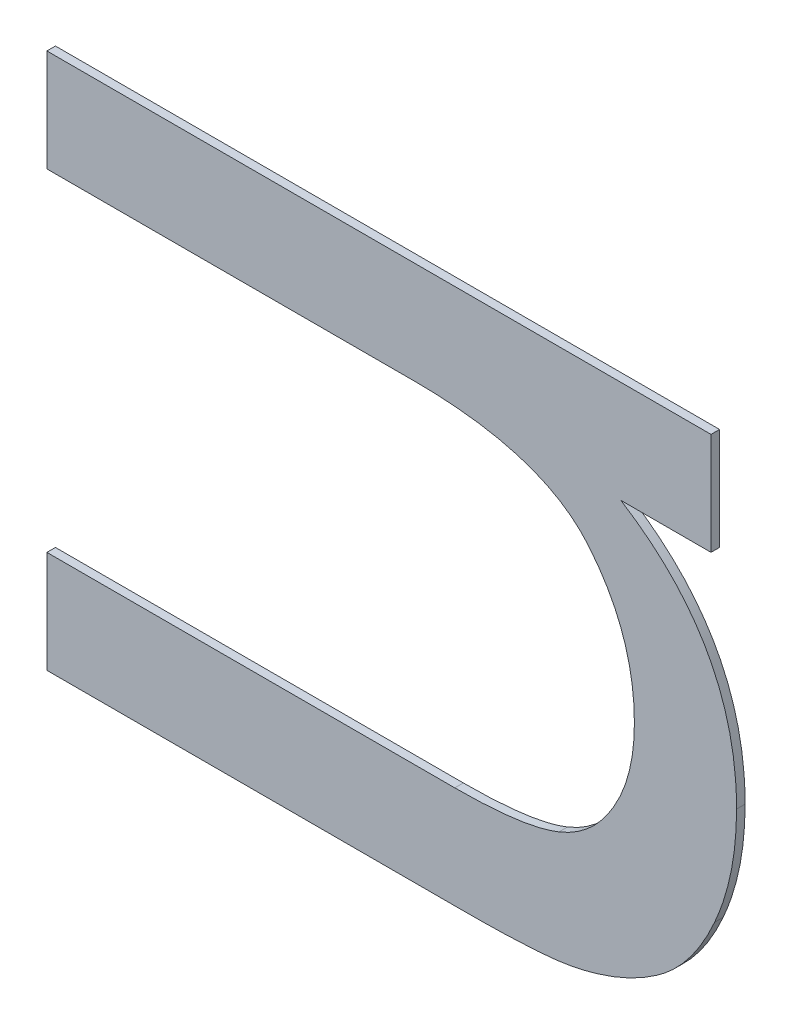
ISO-10303-21;
HEADER;
FILE_DESCRIPTION(('STEP AP214'),'2;1');
FILE_NAME('part.step','',(''),(''),'','','');
FILE_SCHEMA(('AUTOMOTIVE_DESIGN { 1 0 10303 214 1 1 1 1 }'));
ENDSEC;
DATA;
#1=APPLICATION_CONTEXT('core data for automotive mechanical design processes');
#2=APPLICATION_PROTOCOL_DEFINITION('international standard','automotive_design',2000,#1);
#3=PRODUCT_CONTEXT('',#1,'mechanical');
#4=PRODUCT('Part','Part','',(#3));
#5=PRODUCT_RELATED_PRODUCT_CATEGORY('part','',(#4));
#6=PRODUCT_DEFINITION_FORMATION('','',#4);
#7=PRODUCT_DEFINITION_CONTEXT('part definition',#1,'design');
#8=PRODUCT_DEFINITION('design','',#6,#7);
#9=PRODUCT_DEFINITION_SHAPE('','',#8);
#10=(LENGTH_UNIT() NAMED_UNIT(*) SI_UNIT(.MILLI.,.METRE.));
#11=(NAMED_UNIT(*) PLANE_ANGLE_UNIT() SI_UNIT($,.RADIAN.));
#12=(NAMED_UNIT(*) SI_UNIT($,.STERADIAN.) SOLID_ANGLE_UNIT());
#13=UNCERTAINTY_MEASURE_WITH_UNIT(LENGTH_MEASURE(1.E-05),#10,'distance_accuracy_value','');
#14=(GEOMETRIC_REPRESENTATION_CONTEXT(3) GLOBAL_UNCERTAINTY_ASSIGNED_CONTEXT((#13)) GLOBAL_UNIT_ASSIGNED_CONTEXT((#10,
#11,#12)) REPRESENTATION_CONTEXT('',''));
#15=CARTESIAN_POINT('',(0.,0.,0.));
#16=DIRECTION('',(0.,0.,1.));
#17=DIRECTION('',(1.,0.,0.));
#18=AXIS2_PLACEMENT_3D('',#15,#16,#17);
#19=CARTESIAN_POINT('',(1.1006089778178,1.5235473365811,1.7496000059366));
#20=DIRECTION('',(0.,1.,0.));
#21=DIRECTION('',(0.,0.,1.));
#22=AXIS2_PLACEMENT_3D('',#19,#20,#21);
#23=PLANE('',#22);
#24=DIRECTION('',(0.,0.,1.));
#25=VECTOR('',#24,1.);
#26=CARTESIAN_POINT('',(1.0850641795163,1.5235473365811,1.7492000059366));
#27=LINE('',#26,#25);
#28=CARTESIAN_POINT('',(1.0850641795163,1.5235473365811,1.7492000059366));
#29=VERTEX_POINT('',#28);
#30=CARTESIAN_POINT('',(1.0850641795163,1.5235473365811,1.7496000059366));
#31=VERTEX_POINT('',#30);
#32=EDGE_CURVE('E11',#29,#31,#27,.T.);
#33=ORIENTED_EDGE('',*,*,#32,.T.);
#34=DIRECTION('',(1.,0.,0.));
#35=VECTOR('',#34,1.);
#36=CARTESIAN_POINT('',(1.0850641795163,1.5235473365811,1.7496000059366));
#37=LINE('',#36,#35);
#38=CARTESIAN_POINT('',(1.1161537761193,1.5235473365811,1.7496000059366));
#39=VERTEX_POINT('',#38);
#40=EDGE_CURVE('E24',#31,#39,#37,.T.);
#41=ORIENTED_EDGE('',*,*,#40,.T.);
#42=DIRECTION('',(0.,0.,1.));
#43=VECTOR('',#42,1.);
#44=CARTESIAN_POINT('',(1.1161537761193,1.5235473365811,1.7492000059366));
#45=LINE('',#44,#43);
#46=CARTESIAN_POINT('',(1.1161537761193,1.5235473365811,1.7492000059366));
#47=VERTEX_POINT('',#46);
#48=EDGE_CURVE('E381',#47,#39,#45,.T.);
#49=ORIENTED_EDGE('',*,*,#48,.F.);
#50=DIRECTION('',(1.,0.,0.));
#51=VECTOR('',#50,1.);
#52=CARTESIAN_POINT('',(1.0850641795163,1.5235473365811,1.7492000059366));
#53=LINE('',#52,#51);
#54=EDGE_CURVE('E379',#29,#47,#53,.T.);
#55=ORIENTED_EDGE('',*,*,#54,.F.);
#56=EDGE_LOOP('',(#33,#41,#49,#55));
#57=FACE_BOUND('',#56,.T.);
#58=ADVANCED_FACE('F17',(#57),#23,.T.);
#59=CARTESIAN_POINT('',(1.1161537761193,1.5211558291501,1.7496000059366));
#60=DIRECTION('',(1.,0.,0.));
#61=DIRECTION('',(0.,0.,-1.));
#62=AXIS2_PLACEMENT_3D('',#59,#60,#61);
#63=PLANE('',#62);
#64=ORIENTED_EDGE('',*,*,#48,.T.);
#65=DIRECTION('',(0.,-1.,0.));
#66=VECTOR('',#65,1.);
#67=CARTESIAN_POINT('',(1.1161537761193,1.5235473365811,1.7496000059366));
#68=LINE('',#67,#66);
#69=CARTESIAN_POINT('',(1.1161537761193,1.5187643217191,1.7496000059366));
#70=VERTEX_POINT('',#69);
#71=EDGE_CURVE('E377',#39,#70,#68,.T.);
#72=ORIENTED_EDGE('',*,*,#71,.T.);
#73=DIRECTION('',(0.,0.,1.));
#74=VECTOR('',#73,1.);
#75=CARTESIAN_POINT('',(1.1161537761193,1.5187643217191,1.7492000059366));
#76=LINE('',#75,#74);
#77=CARTESIAN_POINT('',(1.1161537761193,1.5187643217191,1.7492000059366));
#78=VERTEX_POINT('',#77);
#79=EDGE_CURVE('E374',#78,#70,#76,.T.);
#80=ORIENTED_EDGE('',*,*,#79,.F.);
#81=DIRECTION('',(0.,-1.,0.));
#82=VECTOR('',#81,1.);
#83=CARTESIAN_POINT('',(1.1161537761193,1.5235473365811,1.7492000059366));
#84=LINE('',#83,#82);
#85=EDGE_CURVE('E371',#47,#78,#84,.T.);
#86=ORIENTED_EDGE('',*,*,#85,.F.);
#87=EDGE_LOOP('',(#64,#72,#80,#86));
#88=FACE_BOUND('',#87,.T.);
#89=ADVANCED_FACE('F387',(#88),#63,.T.);
#90=CARTESIAN_POINT('',(1.1140425234654,1.5187643217191,1.7496000059366));
#91=DIRECTION('',(0.,-1.,0.));
#92=DIRECTION('',(0.,0.,-1.));
#93=AXIS2_PLACEMENT_3D('',#90,#91,#92);
#94=PLANE('',#93);
#95=ORIENTED_EDGE('',*,*,#79,.T.);
#96=DIRECTION('',(-1.,0.,0.));
#97=VECTOR('',#96,1.);
#98=CARTESIAN_POINT('',(1.1161537761193,1.5187643217191,1.7496000059366));
#99=LINE('',#98,#97);
#100=CARTESIAN_POINT('',(1.1119312708115,1.5187643217191,1.7496000059366));
#101=VERTEX_POINT('',#100);
#102=EDGE_CURVE('E369',#70,#101,#99,.T.);
#103=ORIENTED_EDGE('',*,*,#102,.T.);
#104=DIRECTION('',(0.,0.,1.));
#105=VECTOR('',#104,1.);
#106=CARTESIAN_POINT('',(1.1119312708115,1.5187643217191,1.7492000059366));
#107=LINE('',#106,#105);
#108=CARTESIAN_POINT('',(1.1119312708115,1.5187643217191,1.7492000059366));
#109=VERTEX_POINT('',#108);
#110=EDGE_CURVE('E366',#109,#101,#107,.T.);
#111=ORIENTED_EDGE('',*,*,#110,.F.);
#112=DIRECTION('',(-1.,0.,0.));
#113=VECTOR('',#112,1.);
#114=CARTESIAN_POINT('',(1.1161537761193,1.5187643217191,1.7492000059366));
#115=LINE('',#114,#113);
#116=EDGE_CURVE('E360',#78,#109,#115,.T.);
#117=ORIENTED_EDGE('',*,*,#116,.F.);
#118=EDGE_LOOP('',(#95,#103,#111,#117));
#119=FACE_BOUND('',#118,.T.);
#120=ADVANCED_FACE('F393',(#119),#94,.T.);
#121=CARTESIAN_POINT('',(1.1119312708115,1.5187643217191,1.7496000059366));
#122=CARTESIAN_POINT('',(1.1119312708115,1.5187643217191,1.7491200059366));
#123=CARTESIAN_POINT('',(1.1173495298347,1.5153638970907,1.7496000059366));
#124=CARTESIAN_POINT('',(1.1173495298347,1.5153638970907,1.7491200059366));
#125=CARTESIAN_POINT('',(1.1173495298347,1.5089554045217,1.7496000059366));
#126=CARTESIAN_POINT('',(1.1173495298347,1.5089554045217,1.7491200059366));
#127=B_SPLINE_SURFACE_WITH_KNOTS('',2,1,((#121,#122),(#123,#124),(#125,#126)),.UNSPECIFIED.,.F.,
.F.,.F.,(3,3),(2,2),(0.,1.),(0.,0.000239999999999974),.UNSPECIFIED.);
#128=CARTESIAN_POINT('',(1.1119312708115,1.5187643217191,1.7496000059366));
#129=CARTESIAN_POINT('',(1.1173495298347,1.5153638970907,1.7496000059366));
#130=CARTESIAN_POINT('',(1.1173495298347,1.5089554045217,1.7496000059366));
#131=B_SPLINE_CURVE_WITH_KNOTS('',2,(#128,#129,#130),.UNSPECIFIED.,.F.,.F.,(3,3),(0.,1.),.UNSPECIFIED.);
#132=CARTESIAN_POINT('',(1.1173495298347,1.5089554045217,1.7496000059366));
#133=VERTEX_POINT('',#132);
#134=EDGE_CURVE('E356',#101,#133,#131,.T.);
#135=DIRECTION('',(0.,0.,1.));
#136=VECTOR('',#135,1.);
#137=CARTESIAN_POINT('',(1.1173495298347,1.5089554045217,1.7492000059366));
#138=LINE('',#137,#136);
#139=CARTESIAN_POINT('',(1.1173495298347,1.5089554045217,1.7492000059366));
#140=VERTEX_POINT('',#139);
#141=EDGE_CURVE('E350',#140,#133,#138,.T.);
#142=CARTESIAN_POINT('',(1.1119312708115,1.5187643217191,1.7492000059366));
#143=CARTESIAN_POINT('',(1.1173495298347,1.5153638970907,1.7492000059366));
#144=CARTESIAN_POINT('',(1.1173495298347,1.5089554045217,1.7492000059366));
#145=B_SPLINE_CURVE_WITH_KNOTS('',2,(#142,#143,#144),.UNSPECIFIED.,.F.,.F.,(3,3),(0.,1.),.UNSPECIFIED.);
#146=EDGE_CURVE('E342',#109,#140,#145,.T.);
#147=ORIENTED_EDGE('',*,*,#110,.T.);
#148=ORIENTED_EDGE('',*,*,#134,.T.);
#149=ORIENTED_EDGE('',*,*,#141,.F.);
#150=ORIENTED_EDGE('',*,*,#146,.F.);
#151=EDGE_LOOP('',(#147,#148,#149,#150));
#152=FACE_BOUND('',#151,.T.);
#153=ADVANCED_FACE('F397',(#152),#127,.T.);
#154=CARTESIAN_POINT('',(1.1173495298347,1.5089554045217,1.7496000059366));
#155=CARTESIAN_POINT('',(1.1173495298347,1.5089554045217,1.7491200059366));
#156=CARTESIAN_POINT('',(1.1173495298347,1.5061715404029,1.7496000059366));
#157=CARTESIAN_POINT('',(1.1173495298347,1.5061715404029,1.7491200059366));
#158=CARTESIAN_POINT('',(1.1163219289855,1.5038547675791,1.7496000059366));
#159=CARTESIAN_POINT('',(1.1163219289855,1.5038547675791,1.7491200059366));
#160=B_SPLINE_SURFACE_WITH_KNOTS('',2,1,((#154,#155),(#156,#157),(#158,#159)),.UNSPECIFIED.,.F.,
.F.,.F.,(3,3),(2,2),(0.,1.),(0.,0.000239999999999974),.UNSPECIFIED.);
#161=CARTESIAN_POINT('',(1.1173495298347,1.5089554045217,1.7496000059366));
#162=CARTESIAN_POINT('',(1.1173495298347,1.5061715404029,1.7496000059366));
#163=CARTESIAN_POINT('',(1.1163219289855,1.5038547675791,1.7496000059366));
#164=B_SPLINE_CURVE_WITH_KNOTS('',2,(#161,#162,#163),.UNSPECIFIED.,.F.,.F.,(3,3),(0.,1.),.UNSPECIFIED.);
#165=CARTESIAN_POINT('',(1.1163219289855,1.5038547675791,1.7496000059366));
#166=VERTEX_POINT('',#165);
#167=EDGE_CURVE('E338',#133,#166,#164,.T.);
#168=DIRECTION('',(0.,0.,1.));
#169=VECTOR('',#168,1.);
#170=CARTESIAN_POINT('',(1.1163219289855,1.5038547675791,1.7492000059366));
#171=LINE('',#170,#169);
#172=CARTESIAN_POINT('',(1.1163219289855,1.5038547675791,1.7492000059366));
#173=VERTEX_POINT('',#172);
#174=EDGE_CURVE('E332',#173,#166,#171,.T.);
#175=CARTESIAN_POINT('',(1.1173495298347,1.5089554045217,1.7492000059366));
#176=CARTESIAN_POINT('',(1.1173495298347,1.5061715404029,1.7492000059366));
#177=CARTESIAN_POINT('',(1.1163219289855,1.5038547675791,1.7492000059366));
#178=B_SPLINE_CURVE_WITH_KNOTS('',2,(#175,#176,#177),.UNSPECIFIED.,.F.,.F.,(3,3),(0.,1.),.UNSPECIFIED.);
#179=EDGE_CURVE('E324',#140,#173,#178,.T.);
#180=ORIENTED_EDGE('',*,*,#141,.T.);
#181=ORIENTED_EDGE('',*,*,#167,.T.);
#182=ORIENTED_EDGE('',*,*,#174,.F.);
#183=ORIENTED_EDGE('',*,*,#179,.F.);
#184=EDGE_LOOP('',(#180,#181,#182,#183));
#185=FACE_BOUND('',#184,.T.);
#186=ADVANCED_FACE('F401',(#185),#160,.T.);
#187=CARTESIAN_POINT('',(1.1163219289855,1.5038547675791,1.7496000059366));
#188=CARTESIAN_POINT('',(1.1163219289855,1.5038547675791,1.7491200059366));
#189=CARTESIAN_POINT('',(1.1152943281363,1.5015193111035,1.7496000059366));
#190=CARTESIAN_POINT('',(1.1152943281363,1.5015193111035,1.7491200059366));
#191=CARTESIAN_POINT('',(1.1136314831257,1.5003609246915,1.7496000059366));
#192=CARTESIAN_POINT('',(1.1136314831257,1.5003609246915,1.7491200059366));
#193=B_SPLINE_SURFACE_WITH_KNOTS('',2,1,((#187,#188),(#189,#190),(#191,#192)),.UNSPECIFIED.,.F.,
.F.,.F.,(3,3),(2,2),(0.,1.),(0.,0.000239999999999974),.UNSPECIFIED.);
#194=CARTESIAN_POINT('',(1.1163219289855,1.5038547675791,1.7496000059366));
#195=CARTESIAN_POINT('',(1.1152943281363,1.5015193111035,1.7496000059366));
#196=CARTESIAN_POINT('',(1.1136314831257,1.5003609246915,1.7496000059366));
#197=B_SPLINE_CURVE_WITH_KNOTS('',2,(#194,#195,#196),.UNSPECIFIED.,.F.,.F.,(3,3),(0.,1.),.UNSPECIFIED.);
#198=CARTESIAN_POINT('',(1.1136314831257,1.5003609246915,1.7496000059366));
#199=VERTEX_POINT('',#198);
#200=EDGE_CURVE('E320',#166,#199,#197,.T.);
#201=DIRECTION('',(0.,0.,1.));
#202=VECTOR('',#201,1.);
#203=CARTESIAN_POINT('',(1.1136314831257,1.5003609246915,1.7492000059366));
#204=LINE('',#203,#202);
#205=CARTESIAN_POINT('',(1.1136314831257,1.5003609246915,1.7492000059366));
#206=VERTEX_POINT('',#205);
#207=EDGE_CURVE('E314',#206,#199,#204,.T.);
#208=CARTESIAN_POINT('',(1.1163219289855,1.5038547675791,1.7492000059366));
#209=CARTESIAN_POINT('',(1.1152943281363,1.5015193111035,1.7492000059366));
#210=CARTESIAN_POINT('',(1.1136314831257,1.5003609246915,1.7492000059366));
#211=B_SPLINE_CURVE_WITH_KNOTS('',2,(#208,#209,#210),.UNSPECIFIED.,.F.,.F.,(3,3),(0.,1.),.UNSPECIFIED.);
#212=EDGE_CURVE('E306',#173,#206,#211,.T.);
#213=ORIENTED_EDGE('',*,*,#174,.T.);
#214=ORIENTED_EDGE('',*,*,#200,.T.);
#215=ORIENTED_EDGE('',*,*,#207,.F.);
#216=ORIENTED_EDGE('',*,*,#212,.F.);
#217=EDGE_LOOP('',(#213,#214,#215,#216));
#218=FACE_BOUND('',#217,.T.);
#219=ADVANCED_FACE('F404',(#218),#193,.T.);
#220=CARTESIAN_POINT('',(1.1136314831257,1.5003609246915,1.7496000059366));
#221=CARTESIAN_POINT('',(1.1136314831257,1.5003609246915,1.7491200059366));
#222=CARTESIAN_POINT('',(1.1119686381151,1.4991838546279,1.7496000059366));
#223=CARTESIAN_POINT('',(1.1119686381151,1.4991838546279,1.7491200059366));
#224=CARTESIAN_POINT('',(1.1096705489431,1.4987354469845,1.7496000059366));
#225=CARTESIAN_POINT('',(1.1096705489431,1.4987354469845,1.7491200059366));
#226=B_SPLINE_SURFACE_WITH_KNOTS('',2,1,((#220,#221),(#222,#223),(#224,#225)),.UNSPECIFIED.,.F.,
.F.,.F.,(3,3),(2,2),(0.,1.),(0.,0.000239999999999974),.UNSPECIFIED.);
#227=CARTESIAN_POINT('',(1.1136314831257,1.5003609246915,1.7496000059366));
#228=CARTESIAN_POINT('',(1.1119686381151,1.4991838546279,1.7496000059366));
#229=CARTESIAN_POINT('',(1.1096705489431,1.4987354469845,1.7496000059366));
#230=B_SPLINE_CURVE_WITH_KNOTS('',2,(#227,#228,#229),.UNSPECIFIED.,.F.,.F.,(3,3),(0.,1.),.UNSPECIFIED.);
#231=CARTESIAN_POINT('',(1.1096705489431,1.4987354469845,1.7496000059366));
#232=VERTEX_POINT('',#231);
#233=EDGE_CURVE('E302',#199,#232,#230,.T.);
#234=DIRECTION('',(0.,0.,1.));
#235=VECTOR('',#234,1.);
#236=CARTESIAN_POINT('',(1.1096705489431,1.4987354469845,1.7492000059366));
#237=LINE('',#236,#235);
#238=CARTESIAN_POINT('',(1.1096705489431,1.4987354469845,1.7492000059366));
#239=VERTEX_POINT('',#238);
#240=EDGE_CURVE('E296',#239,#232,#237,.T.);
#241=CARTESIAN_POINT('',(1.1136314831257,1.5003609246915,1.7492000059366));
#242=CARTESIAN_POINT('',(1.1119686381151,1.4991838546279,1.7492000059366));
#243=CARTESIAN_POINT('',(1.1096705489431,1.4987354469845,1.7492000059366));
#244=B_SPLINE_CURVE_WITH_KNOTS('',2,(#241,#242,#243),.UNSPECIFIED.,.F.,.F.,(3,3),(0.,1.),.UNSPECIFIED.);
#245=EDGE_CURVE('E288',#206,#239,#244,.T.);
#246=ORIENTED_EDGE('',*,*,#207,.T.);
#247=ORIENTED_EDGE('',*,*,#233,.T.);
#248=ORIENTED_EDGE('',*,*,#240,.F.);
#249=ORIENTED_EDGE('',*,*,#245,.F.);
#250=EDGE_LOOP('',(#246,#247,#248,#249));
#251=FACE_BOUND('',#250,.T.);
#252=ADVANCED_FACE('F409',(#251),#226,.T.);
#253=CARTESIAN_POINT('',(1.1096705489431,1.4987354469845,1.7496000059366));
#254=CARTESIAN_POINT('',(1.1096705489431,1.4987354469845,1.7491200059366));
#255=CARTESIAN_POINT('',(1.1081945404505,1.4984365085557,1.7496000059366));
#256=CARTESIAN_POINT('',(1.1081945404505,1.4984365085557,1.7491200059366));
#257=CARTESIAN_POINT('',(1.1044764937413,1.4984365085557,1.7496000059366));
#258=CARTESIAN_POINT('',(1.1044764937413,1.4984365085557,1.7491200059366));
#259=B_SPLINE_SURFACE_WITH_KNOTS('',2,1,((#253,#254),(#255,#256),(#257,#258)),.UNSPECIFIED.,.F.,
.F.,.F.,(3,3),(2,2),(0.,1.),(0.,0.000239999999999974),.UNSPECIFIED.);
#260=CARTESIAN_POINT('',(1.1096705489431,1.4987354469845,1.7496000059366));
#261=CARTESIAN_POINT('',(1.1081945404505,1.4984365085557,1.7496000059366));
#262=CARTESIAN_POINT('',(1.1044764937413,1.4984365085557,1.7496000059366));
#263=B_SPLINE_CURVE_WITH_KNOTS('',2,(#260,#261,#262),.UNSPECIFIED.,.F.,.F.,(3,3),(0.,1.),.UNSPECIFIED.);
#264=CARTESIAN_POINT('',(1.1044764937413,1.4984365085557,1.7496000059366));
#265=VERTEX_POINT('',#264);
#266=EDGE_CURVE('E284',#232,#265,#263,.T.);
#267=DIRECTION('',(0.,0.,1.));
#268=VECTOR('',#267,1.);
#269=CARTESIAN_POINT('',(1.1044764937413,1.4984365085557,1.7492000059366));
#270=LINE('',#269,#268);
#271=CARTESIAN_POINT('',(1.1044764937413,1.4984365085557,1.7492000059366));
#272=VERTEX_POINT('',#271);
#273=EDGE_CURVE('E278',#272,#265,#270,.T.);
#274=CARTESIAN_POINT('',(1.1096705489431,1.4987354469845,1.7492000059366));
#275=CARTESIAN_POINT('',(1.1081945404505,1.4984365085557,1.7492000059366));
#276=CARTESIAN_POINT('',(1.1044764937413,1.4984365085557,1.7492000059366));
#277=B_SPLINE_CURVE_WITH_KNOTS('',2,(#274,#275,#276),.UNSPECIFIED.,.F.,.F.,(3,3),(0.,1.),.UNSPECIFIED.);
#278=EDGE_CURVE('E273',#239,#272,#277,.T.);
#279=ORIENTED_EDGE('',*,*,#240,.T.);
#280=ORIENTED_EDGE('',*,*,#266,.T.);
#281=ORIENTED_EDGE('',*,*,#273,.F.);
#282=ORIENTED_EDGE('',*,*,#278,.F.);
#283=EDGE_LOOP('',(#279,#280,#281,#282));
#284=FACE_BOUND('',#283,.T.);
#285=ADVANCED_FACE('F413',(#284),#259,.T.);
#286=CARTESIAN_POINT('',(1.0947703366288,1.4984365085557,1.7496000059366));
#287=DIRECTION('',(0.,-1.,0.));
#288=DIRECTION('',(0.,0.,-1.));
#289=AXIS2_PLACEMENT_3D('',#286,#287,#288);
#290=PLANE('',#289);
#291=ORIENTED_EDGE('',*,*,#273,.T.);
#292=DIRECTION('',(-1.,0.,0.));
#293=VECTOR('',#292,1.);
#294=CARTESIAN_POINT('',(1.1044764937413,1.4984365085557,1.7496000059366));
#295=LINE('',#294,#293);
#296=CARTESIAN_POINT('',(1.0850641795163,1.4984365085557,1.7496000059366));
#297=VERTEX_POINT('',#296);
#298=EDGE_CURVE('E271',#265,#297,#295,.T.);
#299=ORIENTED_EDGE('',*,*,#298,.T.);
#300=DIRECTION('',(0.,0.,1.));
#301=VECTOR('',#300,1.);
#302=CARTESIAN_POINT('',(1.0850641795163,1.4984365085557,1.7492000059366));
#303=LINE('',#302,#301);
#304=CARTESIAN_POINT('',(1.0850641795163,1.4984365085557,1.7492000059366));
#305=VERTEX_POINT('',#304);
#306=EDGE_CURVE('E268',#305,#297,#303,.T.);
#307=ORIENTED_EDGE('',*,*,#306,.F.);
#308=DIRECTION('',(-1.,0.,0.));
#309=VECTOR('',#308,1.);
#310=CARTESIAN_POINT('',(1.1044764937413,1.4984365085557,1.7492000059366));
#311=LINE('',#310,#309);
#312=EDGE_CURVE('E265',#272,#305,#311,.T.);
#313=ORIENTED_EDGE('',*,*,#312,.F.);
#314=EDGE_LOOP('',(#291,#299,#307,#313));
#315=FACE_BOUND('',#314,.T.);
#316=ADVANCED_FACE('F417',(#315),#290,.T.);
#317=CARTESIAN_POINT('',(1.0850641795163,1.5008280159867,1.7496000059366));
#318=DIRECTION('',(-1.,0.,0.));
#319=DIRECTION('',(0.,0.,1.));
#320=AXIS2_PLACEMENT_3D('',#317,#318,#319);
#321=PLANE('',#320);
#322=ORIENTED_EDGE('',*,*,#306,.T.);
#323=DIRECTION('',(0.,1.,0.));
#324=VECTOR('',#323,1.);
#325=CARTESIAN_POINT('',(1.0850641795163,1.4984365085557,1.7496000059366));
#326=LINE('',#325,#324);
#327=CARTESIAN_POINT('',(1.0850641795163,1.5032195234177,1.7496000059366));
#328=VERTEX_POINT('',#327);
#329=EDGE_CURVE('E263',#297,#328,#326,.T.);
#330=ORIENTED_EDGE('',*,*,#329,.T.);
#331=DIRECTION('',(0.,0.,1.));
#332=VECTOR('',#331,1.);
#333=CARTESIAN_POINT('',(1.0850641795163,1.5032195234177,1.7492000059366));
#334=LINE('',#333,#332);
#335=CARTESIAN_POINT('',(1.0850641795163,1.5032195234177,1.7492000059366));
#336=VERTEX_POINT('',#335);
#337=EDGE_CURVE('E260',#336,#328,#334,.T.);
#338=ORIENTED_EDGE('',*,*,#337,.F.);
#339=DIRECTION('',(0.,1.,0.));
#340=VECTOR('',#339,1.);
#341=CARTESIAN_POINT('',(1.0850641795163,1.4984365085557,1.7492000059366));
#342=LINE('',#341,#340);
#343=EDGE_CURVE('E257',#305,#336,#342,.T.);
#344=ORIENTED_EDGE('',*,*,#343,.F.);
#345=EDGE_LOOP('',(#322,#330,#338,#344));
#346=FACE_BOUND('',#345,.T.);
#347=ADVANCED_FACE('F420',(#346),#321,.T.);
#348=CARTESIAN_POINT('',(1.0946115255885,1.5032195234177,1.7496000059366));
#349=DIRECTION('',(0.,1.,0.));
#350=DIRECTION('',(0.,0.,1.));
#351=AXIS2_PLACEMENT_3D('',#348,#349,#350);
#352=PLANE('',#351);
#353=ORIENTED_EDGE('',*,*,#337,.T.);
#354=DIRECTION('',(1.,0.,0.));
#355=VECTOR('',#354,1.);
#356=CARTESIAN_POINT('',(1.0850641795163,1.5032195234177,1.7496000059366));
#357=LINE('',#356,#355);
#358=CARTESIAN_POINT('',(1.1041588716607,1.5032195234177,1.7496000059366));
#359=VERTEX_POINT('',#358);
#360=EDGE_CURVE('E255',#328,#359,#357,.T.);
#361=ORIENTED_EDGE('',*,*,#360,.T.);
#362=DIRECTION('',(0.,0.,1.));
#363=VECTOR('',#362,1.);
#364=CARTESIAN_POINT('',(1.1041588716607,1.5032195234177,1.7492000059366));
#365=LINE('',#364,#363);
#366=CARTESIAN_POINT('',(1.1041588716607,1.5032195234177,1.7492000059366));
#367=VERTEX_POINT('',#366);
#368=EDGE_CURVE('E252',#367,#359,#365,.T.);
#369=ORIENTED_EDGE('',*,*,#368,.F.);
#370=DIRECTION('',(1.,0.,0.));
#371=VECTOR('',#370,1.);
#372=CARTESIAN_POINT('',(1.0850641795163,1.5032195234177,1.7492000059366));
#373=LINE('',#372,#371);
#374=EDGE_CURVE('E246',#336,#367,#373,.T.);
#375=ORIENTED_EDGE('',*,*,#374,.F.);
#376=EDGE_LOOP('',(#353,#361,#369,#375));
#377=FACE_BOUND('',#376,.T.);
#378=ADVANCED_FACE('F425',(#377),#352,.T.);
#379=CARTESIAN_POINT('',(1.1041588716607,1.5032195234177,1.7496000059366));
#380=CARTESIAN_POINT('',(1.1041588716607,1.5032195234177,1.7491200059366));
#381=CARTESIAN_POINT('',(1.1074285107265,1.5032195234177,1.7496000059366));
#382=CARTESIAN_POINT('',(1.1074285107265,1.5032195234177,1.7491200059366));
#383=CARTESIAN_POINT('',(1.1090353047817,1.5038734512309,1.7496000059366));
#384=CARTESIAN_POINT('',(1.1090353047817,1.5038734512309,1.7491200059366));
#385=B_SPLINE_SURFACE_WITH_KNOTS('',2,1,((#379,#380),(#381,#382),(#383,#384)),.UNSPECIFIED.,.F.,
.F.,.F.,(3,3),(2,2),(0.,1.),(0.,0.000239999999999974),.UNSPECIFIED.);
#386=CARTESIAN_POINT('',(1.1041588716607,1.5032195234177,1.7496000059366));
#387=CARTESIAN_POINT('',(1.1074285107265,1.5032195234177,1.7496000059366));
#388=CARTESIAN_POINT('',(1.1090353047817,1.5038734512309,1.7496000059366));
#389=B_SPLINE_CURVE_WITH_KNOTS('',2,(#386,#387,#388),.UNSPECIFIED.,.F.,.F.,(3,3),(0.,1.),.UNSPECIFIED.);
#390=CARTESIAN_POINT('',(1.1090353047817,1.5038734512309,1.7496000059366));
#391=VERTEX_POINT('',#390);
#392=EDGE_CURVE('E242',#359,#391,#389,.T.);
#393=DIRECTION('',(0.,0.,1.));
#394=VECTOR('',#393,1.);
#395=CARTESIAN_POINT('',(1.1090353047817,1.5038734512309,1.7492000059366));
#396=LINE('',#395,#394);
#397=CARTESIAN_POINT('',(1.1090353047817,1.5038734512309,1.7492000059366));
#398=VERTEX_POINT('',#397);
#399=EDGE_CURVE('E236',#398,#391,#396,.T.);
#400=CARTESIAN_POINT('',(1.1041588716607,1.5032195234177,1.7492000059366));
#401=CARTESIAN_POINT('',(1.1074285107265,1.5032195234177,1.7492000059366));
#402=CARTESIAN_POINT('',(1.1090353047817,1.5038734512309,1.7492000059366));
#403=B_SPLINE_CURVE_WITH_KNOTS('',2,(#400,#401,#402),.UNSPECIFIED.,.F.,.F.,(3,3),(0.,1.),.UNSPECIFIED.);
#404=EDGE_CURVE('E228',#367,#398,#403,.T.);
#405=ORIENTED_EDGE('',*,*,#368,.T.);
#406=ORIENTED_EDGE('',*,*,#392,.T.);
#407=ORIENTED_EDGE('',*,*,#399,.F.);
#408=ORIENTED_EDGE('',*,*,#404,.F.);
#409=EDGE_LOOP('',(#405,#406,#407,#408));
#410=FACE_BOUND('',#409,.T.);
#411=ADVANCED_FACE('F429',(#410),#385,.T.);
#412=CARTESIAN_POINT('',(1.1090353047817,1.5038734512309,1.7496000059366));
#413=CARTESIAN_POINT('',(1.1090353047817,1.5038734512309,1.7491200059366));
#414=CARTESIAN_POINT('',(1.1106420988369,1.5045086953923,1.7496000059366));
#415=CARTESIAN_POINT('',(1.1106420988369,1.5045086953923,1.7491200059366));
#416=CARTESIAN_POINT('',(1.1115949650789,1.5061715404029,1.7496000059366));
#417=CARTESIAN_POINT('',(1.1115949650789,1.5061715404029,1.7491200059366));
#418=B_SPLINE_SURFACE_WITH_KNOTS('',2,1,((#412,#413),(#414,#415),(#416,#417)),.UNSPECIFIED.,.F.,
.F.,.F.,(3,3),(2,2),(0.,1.),(0.,0.000239999999999974),.UNSPECIFIED.);
#419=CARTESIAN_POINT('',(1.1090353047817,1.5038734512309,1.7496000059366));
#420=CARTESIAN_POINT('',(1.1106420988369,1.5045086953923,1.7496000059366));
#421=CARTESIAN_POINT('',(1.1115949650789,1.5061715404029,1.7496000059366));
#422=B_SPLINE_CURVE_WITH_KNOTS('',2,(#419,#420,#421),.UNSPECIFIED.,.F.,.F.,(3,3),(0.,1.),.UNSPECIFIED.);
#423=CARTESIAN_POINT('',(1.1115949650789,1.5061715404029,1.7496000059366));
#424=VERTEX_POINT('',#423);
#425=EDGE_CURVE('E224',#391,#424,#422,.T.);
#426=DIRECTION('',(0.,0.,1.));
#427=VECTOR('',#426,1.);
#428=CARTESIAN_POINT('',(1.1115949650789,1.5061715404029,1.7492000059366));
#429=LINE('',#428,#427);
#430=CARTESIAN_POINT('',(1.1115949650789,1.5061715404029,1.7492000059366));
#431=VERTEX_POINT('',#430);
#432=EDGE_CURVE('E218',#431,#424,#429,.T.);
#433=CARTESIAN_POINT('',(1.1090353047817,1.5038734512309,1.7492000059366));
#434=CARTESIAN_POINT('',(1.1106420988369,1.5045086953923,1.7492000059366));
#435=CARTESIAN_POINT('',(1.1115949650789,1.5061715404029,1.7492000059366));
#436=B_SPLINE_CURVE_WITH_KNOTS('',2,(#433,#434,#435),.UNSPECIFIED.,.F.,.F.,(3,3),(0.,1.),.UNSPECIFIED.);
#437=EDGE_CURVE('E210',#398,#431,#436,.T.);
#438=ORIENTED_EDGE('',*,*,#399,.T.);
#439=ORIENTED_EDGE('',*,*,#425,.T.);
#440=ORIENTED_EDGE('',*,*,#432,.F.);
#441=ORIENTED_EDGE('',*,*,#437,.F.);
#442=EDGE_LOOP('',(#438,#439,#440,#441));
#443=FACE_BOUND('',#442,.T.);
#444=ADVANCED_FACE('F433',(#443),#418,.T.);
#445=CARTESIAN_POINT('',(1.1115949650789,1.5061715404029,1.7496000059366));
#446=CARTESIAN_POINT('',(1.1115949650789,1.5061715404029,1.7491200059366));
#447=CARTESIAN_POINT('',(1.1125665149727,1.5078157017617,1.7496000059366));
#448=CARTESIAN_POINT('',(1.1125665149727,1.5078157017617,1.7491200059366));
#449=CARTESIAN_POINT('',(1.1125665149727,1.5100577399781,1.7496000059366));
#450=CARTESIAN_POINT('',(1.1125665149727,1.5100577399781,1.7491200059366));
#451=B_SPLINE_SURFACE_WITH_KNOTS('',2,1,((#445,#446),(#447,#448),(#449,#450)),.UNSPECIFIED.,.F.,
.F.,.F.,(3,3),(2,2),(0.,1.),(0.,0.000239999999999974),.UNSPECIFIED.);
#452=CARTESIAN_POINT('',(1.1115949650789,1.5061715404029,1.7496000059366));
#453=CARTESIAN_POINT('',(1.1125665149727,1.5078157017617,1.7496000059366));
#454=CARTESIAN_POINT('',(1.1125665149727,1.5100577399781,1.7496000059366));
#455=B_SPLINE_CURVE_WITH_KNOTS('',2,(#452,#453,#454),.UNSPECIFIED.,.F.,.F.,(3,3),(0.,1.),.UNSPECIFIED.);
#456=CARTESIAN_POINT('',(1.1125665149727,1.5100577399781,1.7496000059366));
#457=VERTEX_POINT('',#456);
#458=EDGE_CURVE('E206',#424,#457,#455,.T.);
#459=DIRECTION('',(0.,0.,1.));
#460=VECTOR('',#459,1.);
#461=CARTESIAN_POINT('',(1.1125665149727,1.5100577399781,1.7492000059366));
#462=LINE('',#461,#460);
#463=CARTESIAN_POINT('',(1.1125665149727,1.5100577399781,1.7492000059366));
#464=VERTEX_POINT('',#463);
#465=EDGE_CURVE('E200',#464,#457,#462,.T.);
#466=CARTESIAN_POINT('',(1.1115949650789,1.5061715404029,1.7492000059366));
#467=CARTESIAN_POINT('',(1.1125665149727,1.5078157017617,1.7492000059366));
#468=CARTESIAN_POINT('',(1.1125665149727,1.5100577399781,1.7492000059366));
#469=B_SPLINE_CURVE_WITH_KNOTS('',2,(#466,#467,#468),.UNSPECIFIED.,.F.,.F.,(3,3),(0.,1.),.UNSPECIFIED.);
#470=EDGE_CURVE('E192',#431,#464,#469,.T.);
#471=ORIENTED_EDGE('',*,*,#432,.T.);
#472=ORIENTED_EDGE('',*,*,#458,.T.);
#473=ORIENTED_EDGE('',*,*,#465,.F.);
#474=ORIENTED_EDGE('',*,*,#470,.F.);
#475=EDGE_LOOP('',(#471,#472,#473,#474));
#476=FACE_BOUND('',#475,.T.);
#477=ADVANCED_FACE('F436',(#476),#451,.T.);
#478=CARTESIAN_POINT('',(1.1125665149727,1.5100577399781,1.7496000059366));
#479=CARTESIAN_POINT('',(1.1125665149727,1.5100577399781,1.7491200059366));
#480=CARTESIAN_POINT('',(1.1125665149727,1.5136076338211,1.7496000059366));
#481=CARTESIAN_POINT('',(1.1125665149727,1.5136076338211,1.7491200059366));
#482=CARTESIAN_POINT('',(1.1103992113635,1.5161859777701,1.7496000059366));
#483=CARTESIAN_POINT('',(1.1103992113635,1.5161859777701,1.7491200059366));
#484=B_SPLINE_SURFACE_WITH_KNOTS('',2,1,((#478,#479),(#480,#481),(#482,#483)),.UNSPECIFIED.,.F.,
.F.,.F.,(3,3),(2,2),(0.,1.),(0.,0.000239999999999974),.UNSPECIFIED.);
#485=CARTESIAN_POINT('',(1.1125665149727,1.5100577399781,1.7496000059366));
#486=CARTESIAN_POINT('',(1.1125665149727,1.5136076338211,1.7496000059366));
#487=CARTESIAN_POINT('',(1.1103992113635,1.5161859777701,1.7496000059366));
#488=B_SPLINE_CURVE_WITH_KNOTS('',2,(#485,#486,#487),.UNSPECIFIED.,.F.,.F.,(3,3),(0.,1.),.UNSPECIFIED.);
#489=CARTESIAN_POINT('',(1.1103992113635,1.5161859777701,1.7496000059366));
#490=VERTEX_POINT('',#489);
#491=EDGE_CURVE('E188',#457,#490,#488,.T.);
#492=DIRECTION('',(0.,0.,1.));
#493=VECTOR('',#492,1.);
#494=CARTESIAN_POINT('',(1.1103992113635,1.5161859777701,1.7492000059366));
#495=LINE('',#494,#493);
#496=CARTESIAN_POINT('',(1.1103992113635,1.5161859777701,1.7492000059366));
#497=VERTEX_POINT('',#496);
#498=EDGE_CURVE('E182',#497,#490,#495,.T.);
#499=CARTESIAN_POINT('',(1.1125665149727,1.5100577399781,1.7492000059366));
#500=CARTESIAN_POINT('',(1.1125665149727,1.5136076338211,1.7492000059366));
#501=CARTESIAN_POINT('',(1.1103992113635,1.5161859777701,1.7492000059366));
#502=B_SPLINE_CURVE_WITH_KNOTS('',2,(#499,#500,#501),.UNSPECIFIED.,.F.,.F.,(3,3),(0.,1.),.UNSPECIFIED.);
#503=EDGE_CURVE('E175',#464,#497,#502,.T.);
#504=ORIENTED_EDGE('',*,*,#465,.T.);
#505=ORIENTED_EDGE('',*,*,#491,.T.);
#506=ORIENTED_EDGE('',*,*,#498,.F.);
#507=ORIENTED_EDGE('',*,*,#503,.F.);
#508=EDGE_LOOP('',(#504,#505,#506,#507));
#509=FACE_BOUND('',#508,.T.);
#510=ADVANCED_FACE('F440',(#509),#484,.T.);
#511=CARTESIAN_POINT('',(1.1103992113635,1.5161859777701,1.7496000059366));
#512=CARTESIAN_POINT('',(1.1103992113635,1.5161859777701,1.7491200059366));
#513=CARTESIAN_POINT('',(1.1082505914059,1.5187643217191,1.7496000059366));
#514=CARTESIAN_POINT('',(1.1082505914059,1.5187643217191,1.7491200059366));
#515=CARTESIAN_POINT('',(1.1022157718729,1.5187643217191,1.7496000059366));
#516=CARTESIAN_POINT('',(1.1022157718729,1.5187643217191,1.7491200059366));
#517=B_SPLINE_SURFACE_WITH_KNOTS('',2,1,((#511,#512),(#513,#514),(#515,#516)),.UNSPECIFIED.,.F.,
.F.,.F.,(3,3),(2,2),(0.,1.),(0.,0.000239999999999974),.UNSPECIFIED.);
#518=CARTESIAN_POINT('',(1.1103992113635,1.5161859777701,1.7496000059366));
#519=CARTESIAN_POINT('',(1.1082505914059,1.5187643217191,1.7496000059366));
#520=CARTESIAN_POINT('',(1.1022157718729,1.5187643217191,1.7496000059366));
#521=B_SPLINE_CURVE_WITH_KNOTS('',2,(#518,#519,#520),.UNSPECIFIED.,.F.,.F.,(3,3),(0.,1.),.UNSPECIFIED.);
#522=CARTESIAN_POINT('',(1.1022157718729,1.5187643217191,1.7496000059366));
#523=VERTEX_POINT('',#522);
#524=EDGE_CURVE('E171',#490,#523,#521,.T.);
#525=DIRECTION('',(0.,0.,1.));
#526=VECTOR('',#525,1.);
#527=CARTESIAN_POINT('',(1.1022157718729,1.5187643217191,1.7492000059366));
#528=LINE('',#527,#526);
#529=CARTESIAN_POINT('',(1.1022157718729,1.5187643217191,1.7492000059366));
#530=VERTEX_POINT('',#529);
#531=EDGE_CURVE('E166',#530,#523,#528,.T.);
#532=CARTESIAN_POINT('',(1.1103992113635,1.5161859777701,1.7492000059366));
#533=CARTESIAN_POINT('',(1.1082505914059,1.5187643217191,1.7492000059366));
#534=CARTESIAN_POINT('',(1.1022157718729,1.5187643217191,1.7492000059366));
#535=B_SPLINE_CURVE_WITH_KNOTS('',2,(#532,#533,#534),.UNSPECIFIED.,.F.,.F.,(3,3),(0.,1.),.UNSPECIFIED.);
#536=EDGE_CURVE('E155',#497,#530,#535,.T.);
#537=ORIENTED_EDGE('',*,*,#498,.T.);
#538=ORIENTED_EDGE('',*,*,#524,.T.);
#539=ORIENTED_EDGE('',*,*,#531,.F.);
#540=ORIENTED_EDGE('',*,*,#536,.F.);
#541=EDGE_LOOP('',(#537,#538,#539,#540));
#542=FACE_BOUND('',#541,.T.);
#543=ADVANCED_FACE('F443',(#542),#517,.T.);
#544=CARTESIAN_POINT('',(1.0936399756946,1.5187643217191,1.7496000059366));
#545=DIRECTION('',(0.,-1.,0.));
#546=DIRECTION('',(0.,0.,-1.));
#547=AXIS2_PLACEMENT_3D('',#544,#545,#546);
#548=PLANE('',#547);
#549=ORIENTED_EDGE('',*,*,#531,.T.);
#550=DIRECTION('',(-1.,0.,0.));
#551=VECTOR('',#550,1.);
#552=CARTESIAN_POINT('',(1.1022157718729,1.5187643217191,1.7496000059366));
#553=LINE('',#552,#551);
#554=CARTESIAN_POINT('',(1.0850641795163,1.5187643217191,1.7496000059366));
#555=VERTEX_POINT('',#554);
#556=EDGE_CURVE('E144',#523,#555,#553,.T.);
#557=ORIENTED_EDGE('',*,*,#556,.T.);
#558=DIRECTION('',(0.,0.,1.));
#559=VECTOR('',#558,1.);
#560=CARTESIAN_POINT('',(1.0850641795163,1.5187643217191,1.7492000059366));
#561=LINE('',#560,#559);
#562=CARTESIAN_POINT('',(1.0850641795163,1.5187643217191,1.7492000059366));
#563=VERTEX_POINT('',#562);
#564=EDGE_CURVE('E138',#563,#555,#561,.T.);
#565=ORIENTED_EDGE('',*,*,#564,.F.);
#566=DIRECTION('',(-1.,0.,0.));
#567=VECTOR('',#566,1.);
#568=CARTESIAN_POINT('',(1.1022157718729,1.5187643217191,1.7492000059366));
#569=LINE('',#568,#567);
#570=EDGE_CURVE('E142',#530,#563,#569,.T.);
#571=ORIENTED_EDGE('',*,*,#570,.F.);
#572=EDGE_LOOP('',(#549,#557,#565,#571));
#573=FACE_BOUND('',#572,.T.);
#574=ADVANCED_FACE('F141',(#573),#548,.T.);
#575=CARTESIAN_POINT('',(1.0850641795163,1.5211558291501,1.7496000059366));
#576=DIRECTION('',(-1.,0.,0.));
#577=DIRECTION('',(0.,0.,1.));
#578=AXIS2_PLACEMENT_3D('',#575,#576,#577);
#579=PLANE('',#578);
#580=ORIENTED_EDGE('',*,*,#564,.T.);
#581=DIRECTION('',(0.,1.,0.));
#582=VECTOR('',#581,1.);
#583=CARTESIAN_POINT('',(1.0850641795163,1.5187643217191,1.7496000059366));
#584=LINE('',#583,#582);
#585=EDGE_CURVE('E156',#555,#31,#584,.T.);
#586=ORIENTED_EDGE('',*,*,#585,.T.);
#587=ORIENTED_EDGE('',*,*,#32,.F.);
#588=DIRECTION('',(0.,1.,0.));
#589=VECTOR('',#588,1.);
#590=CARTESIAN_POINT('',(1.0850641795163,1.5187643217191,1.7492000059366));
#591=LINE('',#590,#589);
#592=EDGE_CURVE('E152',#563,#29,#591,.T.);
#593=ORIENTED_EDGE('',*,*,#592,.F.);
#594=EDGE_LOOP('',(#580,#586,#587,#593));
#595=FACE_BOUND('',#594,.T.);
#596=ADVANCED_FACE('F158',(#595),#579,.T.);
#597=CARTESIAN_POINT('',(1.0850641795163,1.5109919225684,1.7492000059366));
#598=DIRECTION('',(0.,0.,-1.));
#599=DIRECTION('',(-1.,0.,0.));
#600=AXIS2_PLACEMENT_3D('',#597,#598,#599);
#601=PLANE('',#600);
#602=ORIENTED_EDGE('',*,*,#54,.T.);
#603=ORIENTED_EDGE('',*,*,#85,.T.);
#604=ORIENTED_EDGE('',*,*,#116,.T.);
#605=ORIENTED_EDGE('',*,*,#146,.T.);
#606=ORIENTED_EDGE('',*,*,#179,.T.);
#607=ORIENTED_EDGE('',*,*,#212,.T.);
#608=ORIENTED_EDGE('',*,*,#245,.T.);
#609=ORIENTED_EDGE('',*,*,#278,.T.);
#610=ORIENTED_EDGE('',*,*,#312,.T.);
#611=ORIENTED_EDGE('',*,*,#343,.T.);
#612=ORIENTED_EDGE('',*,*,#374,.T.);
#613=ORIENTED_EDGE('',*,*,#404,.T.);
#614=ORIENTED_EDGE('',*,*,#437,.T.);
#615=ORIENTED_EDGE('',*,*,#470,.T.);
#616=ORIENTED_EDGE('',*,*,#503,.T.);
#617=ORIENTED_EDGE('',*,*,#536,.T.);
#618=ORIENTED_EDGE('',*,*,#570,.T.);
#619=ORIENTED_EDGE('',*,*,#592,.T.);
#620=EDGE_LOOP('',(#602,#603,#604,#605,#606,#607,#608,#609,#610,#611,#612,#613,#614,#615,#616,
#617,#618,#619));
#621=FACE_BOUND('',#620,.T.);
#622=ADVANCED_FACE('F151',(#621),#601,.T.);
#623=CARTESIAN_POINT('',(1.0850641795163,1.5109919225684,1.7496000059366));
#624=DIRECTION('',(0.,0.,-1.));
#625=DIRECTION('',(-1.,0.,0.));
#626=AXIS2_PLACEMENT_3D('',#623,#624,#625);
#627=PLANE('',#626);
#628=ORIENTED_EDGE('',*,*,#40,.F.);
#629=ORIENTED_EDGE('',*,*,#585,.F.);
#630=ORIENTED_EDGE('',*,*,#556,.F.);
#631=ORIENTED_EDGE('',*,*,#524,.F.);
#632=ORIENTED_EDGE('',*,*,#491,.F.);
#633=ORIENTED_EDGE('',*,*,#458,.F.);
#634=ORIENTED_EDGE('',*,*,#425,.F.);
#635=ORIENTED_EDGE('',*,*,#392,.F.);
#636=ORIENTED_EDGE('',*,*,#360,.F.);
#637=ORIENTED_EDGE('',*,*,#329,.F.);
#638=ORIENTED_EDGE('',*,*,#298,.F.);
#639=ORIENTED_EDGE('',*,*,#266,.F.);
#640=ORIENTED_EDGE('',*,*,#233,.F.);
#641=ORIENTED_EDGE('',*,*,#200,.F.);
#642=ORIENTED_EDGE('',*,*,#167,.F.);
#643=ORIENTED_EDGE('',*,*,#134,.F.);
#644=ORIENTED_EDGE('',*,*,#102,.F.);
#645=ORIENTED_EDGE('',*,*,#71,.F.);
#646=EDGE_LOOP('',(#628,#629,#630,#631,#632,#633,#634,#635,#636,#637,#638,#639,#640,#641,#642,
#643,#644,#645));
#647=FACE_BOUND('',#646,.T.);
#648=ADVANCED_FACE('F389',(#647),#627,.F.);
#649=CLOSED_SHELL('',(#58,#89,#120,#153,#186,#219,#252,#285,#316,#347,#378,#411,#444,#477,#510,
#543,#574,#596,#622,#648));
#650=MANIFOLD_SOLID_BREP('B1',#649);
#651=ADVANCED_BREP_SHAPE_REPRESENTATION('',(#18,#650),#14);
#652=SHAPE_DEFINITION_REPRESENTATION(#9,#651);
ENDSEC;
END-ISO-10303-21;
